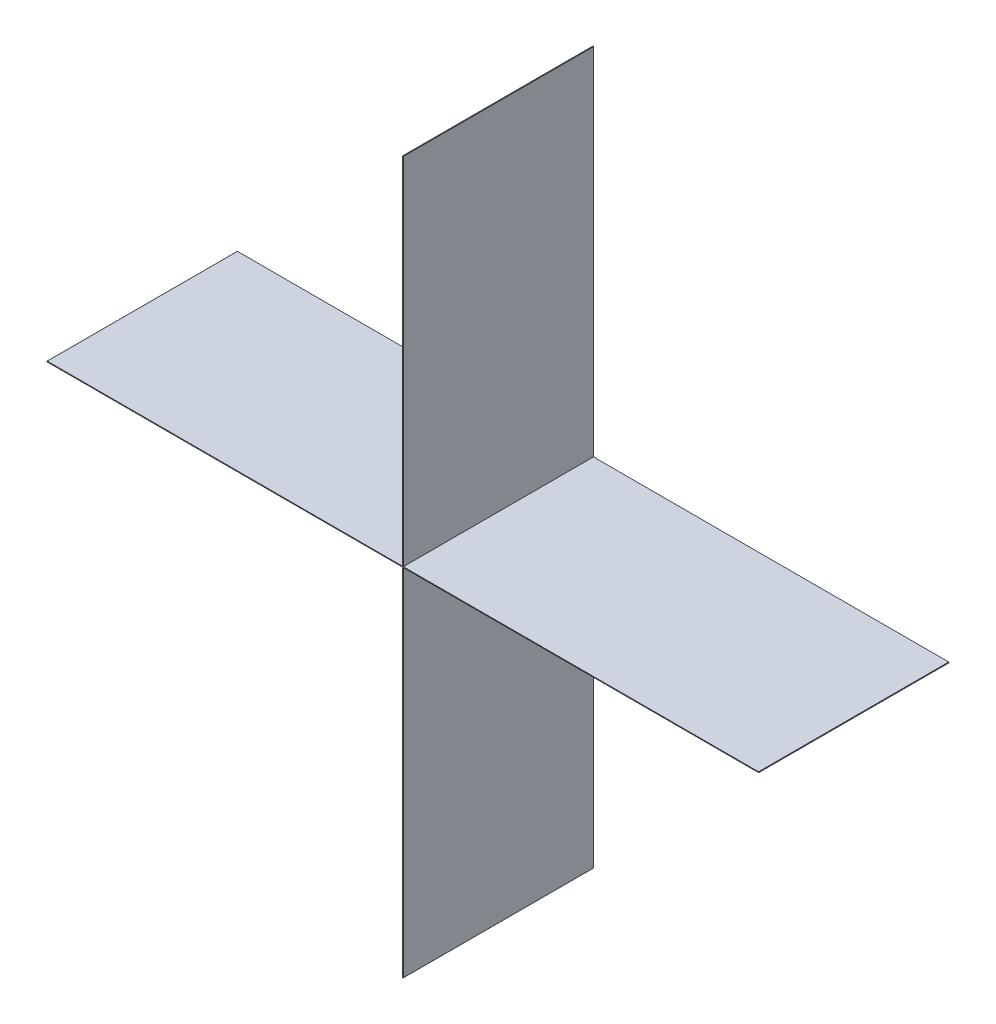
ISO-10303-21;
HEADER;
FILE_DESCRIPTION(('STEP AP214'),'2;1');
FILE_NAME('part.step','',(''),(''),'','','');
FILE_SCHEMA(('AUTOMOTIVE_DESIGN { 1 0 10303 214 1 1 1 1 }'));
ENDSEC;
DATA;
#1=APPLICATION_CONTEXT('core data for automotive mechanical design processes');
#2=APPLICATION_PROTOCOL_DEFINITION('international standard','automotive_design',2000,#1);
#3=PRODUCT_CONTEXT('',#1,'mechanical');
#4=PRODUCT('Part','Part','',(#3));
#5=PRODUCT_RELATED_PRODUCT_CATEGORY('part','',(#4));
#6=PRODUCT_DEFINITION_FORMATION('','',#4);
#7=PRODUCT_DEFINITION_CONTEXT('part definition',#1,'design');
#8=PRODUCT_DEFINITION('design','',#6,#7);
#9=PRODUCT_DEFINITION_SHAPE('','',#8);
#10=(LENGTH_UNIT() NAMED_UNIT(*) SI_UNIT(.MILLI.,.METRE.));
#11=(NAMED_UNIT(*) PLANE_ANGLE_UNIT() SI_UNIT($,.RADIAN.));
#12=(NAMED_UNIT(*) SI_UNIT($,.STERADIAN.) SOLID_ANGLE_UNIT());
#13=UNCERTAINTY_MEASURE_WITH_UNIT(LENGTH_MEASURE(1.E-05),#10,'distance_accuracy_value','');
#14=(GEOMETRIC_REPRESENTATION_CONTEXT(3) GLOBAL_UNCERTAINTY_ASSIGNED_CONTEXT((#13)) GLOBAL_UNIT_ASSIGNED_CONTEXT((#10,
#11,#12)) REPRESENTATION_CONTEXT('',''));
#15=CARTESIAN_POINT('',(0.,0.,0.));
#16=DIRECTION('',(0.,0.,1.));
#17=DIRECTION('',(1.,0.,0.));
#18=AXIS2_PLACEMENT_3D('',#15,#16,#17);
#19=CARTESIAN_POINT('',(-0.47499778,0.000508,0.));
#20=DIRECTION('',(0.,-1.,0.));
#21=DIRECTION('',(-1.,0.,0.));
#22=AXIS2_PLACEMENT_3D('',#19,#20,#21);
#23=PLANE('',#22);
#24=DIRECTION('',(-1.,0.,0.));
#25=VECTOR('',#24,1.);
#26=CARTESIAN_POINT('',(-0.47499778,0.000508,0.));
#27=LINE('',#26,#25);
#28=CARTESIAN_POINT('',(-0.47499778,0.000508,0.));
#29=VERTEX_POINT('',#28);
#30=CARTESIAN_POINT('',(-0.4752086,0.000508,0.));
#31=VERTEX_POINT('',#30);
#32=EDGE_CURVE('E11',#29,#31,#27,.T.);
#33=ORIENTED_EDGE('',*,*,#32,.T.);
#34=DIRECTION('',(0.,0.,1.));
#35=VECTOR('',#34,1.);
#36=CARTESIAN_POINT('',(-0.4752086,0.000508,0.));
#37=LINE('',#36,#35);
#38=CARTESIAN_POINT('',(-0.4752086,0.000508,0.254));
#39=VERTEX_POINT('',#38);
#40=EDGE_CURVE('E24',#31,#39,#37,.T.);
#41=ORIENTED_EDGE('',*,*,#40,.T.);
#42=DIRECTION('',(-1.,0.,0.));
#43=VECTOR('',#42,1.);
#44=CARTESIAN_POINT('',(-0.47499778,0.000508,0.254));
#45=LINE('',#44,#43);
#46=CARTESIAN_POINT('',(-0.47499778,0.000508,0.254));
#47=VERTEX_POINT('',#46);
#48=EDGE_CURVE('E494',#47,#39,#45,.T.);
#49=ORIENTED_EDGE('',*,*,#48,.F.);
#50=DIRECTION('',(0.,0.,1.));
#51=VECTOR('',#50,1.);
#52=CARTESIAN_POINT('',(-0.47499778,0.000508,0.));
#53=LINE('',#52,#51);
#54=EDGE_CURVE('E36',#29,#47,#53,.T.);
#55=ORIENTED_EDGE('',*,*,#54,.F.);
#56=EDGE_LOOP('',(#33,#41,#49,#55));
#57=FACE_BOUND('',#56,.T.);
#58=ADVANCED_FACE('F17',(#57),#23,.F.);
#59=CARTESIAN_POINT('',(-0.4752086,0.000508,0.));
#60=DIRECTION('',(0.71010931698383,-0.704091441456831,0.));
#61=DIRECTION('',(-0.704091441456831,-0.71010931698383,0.));
#62=AXIS2_PLACEMENT_3D('',#59,#60,#61);
#63=PLANE('',#62);
#64=DIRECTION('',(-0.704091441456831,-0.71010931698383,0.));
#65=VECTOR('',#64,1.);
#66=CARTESIAN_POINT('',(-0.4752086,0.000508,0.));
#67=LINE('',#66,#65);
#68=CARTESIAN_POINT('',(-0.47550578,0.000208279999999,0.));
#69=VERTEX_POINT('',#68);
#70=EDGE_CURVE('E491',#31,#69,#67,.T.);
#71=ORIENTED_EDGE('',*,*,#70,.T.);
#72=DIRECTION('',(0.,0.,1.));
#73=VECTOR('',#72,1.);
#74=CARTESIAN_POINT('',(-0.47550578,0.000208279999999,0.));
#75=LINE('',#74,#73);
#76=CARTESIAN_POINT('',(-0.47550578,0.000208279999999,0.254));
#77=VERTEX_POINT('',#76);
#78=EDGE_CURVE('E488',#69,#77,#75,.T.);
#79=ORIENTED_EDGE('',*,*,#78,.T.);
#80=DIRECTION('',(-0.704091441456831,-0.71010931698383,0.));
#81=VECTOR('',#80,1.);
#82=CARTESIAN_POINT('',(-0.4752086,0.000508,0.254));
#83=LINE('',#82,#81);
#84=EDGE_CURVE('E486',#39,#77,#83,.T.);
#85=ORIENTED_EDGE('',*,*,#84,.F.);
#86=ORIENTED_EDGE('',*,*,#40,.F.);
#87=EDGE_LOOP('',(#71,#79,#85,#86));
#88=FACE_BOUND('',#87,.T.);
#89=ADVANCED_FACE('F496',(#88),#63,.F.);
#90=CARTESIAN_POINT('',(-0.47550578,0.000208279999999,0.));
#91=DIRECTION('',(1.,0.,0.));
#92=DIRECTION('',(0.,-1.,0.));
#93=AXIS2_PLACEMENT_3D('',#90,#91,#92);
#94=PLANE('',#93);
#95=DIRECTION('',(0.,-1.,0.));
#96=VECTOR('',#95,1.);
#97=CARTESIAN_POINT('',(-0.47550578,0.000208279999999,0.));
#98=LINE('',#97,#96);
#99=CARTESIAN_POINT('',(-0.47550578,-0.0002108199999995,0.));
#100=VERTEX_POINT('',#99);
#101=EDGE_CURVE('E483',#69,#100,#98,.T.);
#102=ORIENTED_EDGE('',*,*,#101,.T.);
#103=DIRECTION('',(0.,0.,1.));
#104=VECTOR('',#103,1.);
#105=CARTESIAN_POINT('',(-0.47550578,-0.0002108199999995,0.));
#106=LINE('',#105,#104);
#107=CARTESIAN_POINT('',(-0.47550578,-0.0002108199999995,0.254));
#108=VERTEX_POINT('',#107);
#109=EDGE_CURVE('E480',#100,#108,#106,.T.);
#110=ORIENTED_EDGE('',*,*,#109,.T.);
#111=DIRECTION('',(0.,-1.,0.));
#112=VECTOR('',#111,1.);
#113=CARTESIAN_POINT('',(-0.47550578,0.000208279999999,0.254));
#114=LINE('',#113,#112);
#115=EDGE_CURVE('E478',#77,#108,#114,.T.);
#116=ORIENTED_EDGE('',*,*,#115,.F.);
#117=ORIENTED_EDGE('',*,*,#78,.F.);
#118=EDGE_LOOP('',(#102,#110,#116,#117));
#119=FACE_BOUND('',#118,.T.);
#120=ADVANCED_FACE('F500',(#119),#94,.F.);
#121=CARTESIAN_POINT('',(-0.47550578,-0.0002108199999995,0.));
#122=DIRECTION('',(0.707106781165048,0.707106781208048,0.));
#123=DIRECTION('',(0.707106781208048,-0.707106781165048,0.));
#124=AXIS2_PLACEMENT_3D('',#121,#122,#123);
#125=PLANE('',#124);
#126=DIRECTION('',(0.707106781208048,-0.707106781165048,0.));
#127=VECTOR('',#126,1.);
#128=CARTESIAN_POINT('',(-0.47550578,-0.0002108199999995,0.));
#129=LINE('',#128,#127);
#130=CARTESIAN_POINT('',(-0.4752086,-0.000508,0.));
#131=VERTEX_POINT('',#130);
#132=EDGE_CURVE('E475',#100,#131,#129,.T.);
#133=ORIENTED_EDGE('',*,*,#132,.T.);
#134=DIRECTION('',(0.,0.,1.));
#135=VECTOR('',#134,1.);
#136=CARTESIAN_POINT('',(-0.4752086,-0.000508,0.));
#137=LINE('',#136,#135);
#138=CARTESIAN_POINT('',(-0.4752086,-0.000508,0.254));
#139=VERTEX_POINT('',#138);
#140=EDGE_CURVE('E472',#131,#139,#137,.T.);
#141=ORIENTED_EDGE('',*,*,#140,.T.);
#142=DIRECTION('',(0.707106781208048,-0.707106781165048,0.));
#143=VECTOR('',#142,1.);
#144=CARTESIAN_POINT('',(-0.47550578,-0.0002108199999995,0.254));
#145=LINE('',#144,#143);
#146=EDGE_CURVE('E470',#108,#139,#145,.T.);
#147=ORIENTED_EDGE('',*,*,#146,.F.);
#148=ORIENTED_EDGE('',*,*,#109,.F.);
#149=EDGE_LOOP('',(#133,#141,#147,#148));
#150=FACE_BOUND('',#149,.T.);
#151=ADVANCED_FACE('F504',(#150),#125,.F.);
#152=CARTESIAN_POINT('',(-0.4752086,-0.000508,0.));
#153=DIRECTION('',(0.,1.,0.));
#154=DIRECTION('',(1.,0.,0.));
#155=AXIS2_PLACEMENT_3D('',#152,#153,#154);
#156=PLANE('',#155);
#157=DIRECTION('',(1.,0.,0.));
#158=VECTOR('',#157,1.);
#159=CARTESIAN_POINT('',(-0.4752086,-0.000508,0.));
#160=LINE('',#159,#158);
#161=CARTESIAN_POINT('',(-0.47499778,-0.000508,0.));
#162=VERTEX_POINT('',#161);
#163=EDGE_CURVE('E467',#131,#162,#160,.T.);
#164=ORIENTED_EDGE('',*,*,#163,.T.);
#165=DIRECTION('',(0.,0.,1.));
#166=VECTOR('',#165,1.);
#167=CARTESIAN_POINT('',(-0.47499778,-0.000508,0.));
#168=LINE('',#167,#166);
#169=CARTESIAN_POINT('',(-0.47499778,-0.000508,0.254));
#170=VERTEX_POINT('',#169);
#171=EDGE_CURVE('E464',#162,#170,#168,.T.);
#172=ORIENTED_EDGE('',*,*,#171,.T.);
#173=DIRECTION('',(1.,0.,0.));
#174=VECTOR('',#173,1.);
#175=CARTESIAN_POINT('',(-0.4752086,-0.000508,0.254));
#176=LINE('',#175,#174);
#177=EDGE_CURVE('E462',#139,#170,#176,.T.);
#178=ORIENTED_EDGE('',*,*,#177,.F.);
#179=ORIENTED_EDGE('',*,*,#140,.F.);
#180=EDGE_LOOP('',(#164,#172,#178,#179));
#181=FACE_BOUND('',#180,.T.);
#182=ADVANCED_FACE('F508',(#181),#156,.F.);
#183=CARTESIAN_POINT('',(-0.47499778,-0.000508,0.));
#184=DIRECTION('',(0.,1.,0.));
#185=DIRECTION('',(1.,0.,0.));
#186=AXIS2_PLACEMENT_3D('',#183,#184,#185);
#187=PLANE('',#186);
#188=DIRECTION('',(1.,0.,0.));
#189=VECTOR('',#188,1.);
#190=CARTESIAN_POINT('',(-0.47499778,-0.000508,0.));
#191=LINE('',#190,#189);
#192=CARTESIAN_POINT('',(-0.0005054599999852,-0.000508,0.));
#193=VERTEX_POINT('',#192);
#194=EDGE_CURVE('E459',#162,#193,#191,.T.);
#195=ORIENTED_EDGE('',*,*,#194,.T.);
#196=DIRECTION('',(0.,0.,1.));
#197=VECTOR('',#196,1.);
#198=CARTESIAN_POINT('',(-0.0005054599999852,-0.000508,0.));
#199=LINE('',#198,#197);
#200=CARTESIAN_POINT('',(-0.0005054599999852,-0.000508,0.254));
#201=VERTEX_POINT('',#200);
#202=EDGE_CURVE('E456',#193,#201,#199,.T.);
#203=ORIENTED_EDGE('',*,*,#202,.T.);
#204=DIRECTION('',(1.,0.,0.));
#205=VECTOR('',#204,1.);
#206=CARTESIAN_POINT('',(-0.47499778,-0.000508,0.254));
#207=LINE('',#206,#205);
#208=EDGE_CURVE('E454',#170,#201,#207,.T.);
#209=ORIENTED_EDGE('',*,*,#208,.F.);
#210=ORIENTED_EDGE('',*,*,#171,.F.);
#211=EDGE_LOOP('',(#195,#203,#209,#210));
#212=FACE_BOUND('',#211,.T.);
#213=ADVANCED_FACE('F512',(#212),#187,.F.);
#214=CARTESIAN_POINT('',(-0.0005054599999852,-0.000508,0.));
#215=DIRECTION('',(1.,0.,0.));
#216=DIRECTION('',(0.,-1.,0.));
#217=AXIS2_PLACEMENT_3D('',#214,#215,#216);
#218=PLANE('',#217);
#219=DIRECTION('',(0.,-1.,0.));
#220=VECTOR('',#219,1.);
#221=CARTESIAN_POINT('',(-0.0005054599999852,-0.000508,0.));
#222=LINE('',#221,#220);
#223=CARTESIAN_POINT('',(-0.0005054599999852,-0.47500032,0.));
#224=VERTEX_POINT('',#223);
#225=EDGE_CURVE('E451',#193,#224,#222,.T.);
#226=ORIENTED_EDGE('',*,*,#225,.T.);
#227=DIRECTION('',(0.,0.,1.));
#228=VECTOR('',#227,1.);
#229=CARTESIAN_POINT('',(-0.0005054599999852,-0.47500032,0.));
#230=LINE('',#229,#228);
#231=CARTESIAN_POINT('',(-0.0005054599999852,-0.47500032,0.254));
#232=VERTEX_POINT('',#231);
#233=EDGE_CURVE('E448',#224,#232,#230,.T.);
#234=ORIENTED_EDGE('',*,*,#233,.T.);
#235=DIRECTION('',(0.,-1.,0.));
#236=VECTOR('',#235,1.);
#237=CARTESIAN_POINT('',(-0.0005054599999852,-0.000508,0.254));
#238=LINE('',#237,#236);
#239=EDGE_CURVE('E446',#201,#232,#238,.T.);
#240=ORIENTED_EDGE('',*,*,#239,.F.);
#241=ORIENTED_EDGE('',*,*,#202,.F.);
#242=EDGE_LOOP('',(#226,#234,#240,#241));
#243=FACE_BOUND('',#242,.T.);
#244=ADVANCED_FACE('F516',(#243),#218,.F.);
#245=CARTESIAN_POINT('',(-0.0005054599999852,-0.47500032,0.));
#246=DIRECTION('',(1.,0.,0.));
#247=DIRECTION('',(0.,-1.,0.));
#248=AXIS2_PLACEMENT_3D('',#245,#246,#247);
#249=PLANE('',#248);
#250=DIRECTION('',(0.,-1.,0.));
#251=VECTOR('',#250,1.);
#252=CARTESIAN_POINT('',(-0.0005054599999852,-0.47500032,0.));
#253=LINE('',#252,#251);
#254=CARTESIAN_POINT('',(-0.0005054599999852,-0.47521114,0.));
#255=VERTEX_POINT('',#254);
#256=EDGE_CURVE('E443',#224,#255,#253,.T.);
#257=ORIENTED_EDGE('',*,*,#256,.T.);
#258=DIRECTION('',(0.,0.,1.));
#259=VECTOR('',#258,1.);
#260=CARTESIAN_POINT('',(-0.0005054599999852,-0.47521114,0.));
#261=LINE('',#260,#259);
#262=CARTESIAN_POINT('',(-0.0005054599999852,-0.47521114,0.254));
#263=VERTEX_POINT('',#262);
#264=EDGE_CURVE('E440',#255,#263,#261,.T.);
#265=ORIENTED_EDGE('',*,*,#264,.T.);
#266=DIRECTION('',(0.,-1.,0.));
#267=VECTOR('',#266,1.);
#268=CARTESIAN_POINT('',(-0.0005054599999852,-0.47500032,0.254));
#269=LINE('',#268,#267);
#270=EDGE_CURVE('E438',#232,#263,#269,.T.);
#271=ORIENTED_EDGE('',*,*,#270,.F.);
#272=ORIENTED_EDGE('',*,*,#233,.F.);
#273=EDGE_LOOP('',(#257,#265,#271,#272));
#274=FACE_BOUND('',#273,.T.);
#275=ADVANCED_FACE('F520',(#274),#249,.F.);
#276=CARTESIAN_POINT('',(-0.0005054599999852,-0.47521114,0.));
#277=DIRECTION('',(0.707106781199048,0.707106781174048,0.));
#278=DIRECTION('',(0.707106781174048,-0.707106781199048,0.));
#279=AXIS2_PLACEMENT_3D('',#276,#277,#278);
#280=PLANE('',#279);
#281=DIRECTION('',(0.707106781174048,-0.707106781199048,0.));
#282=VECTOR('',#281,1.);
#283=CARTESIAN_POINT('',(-0.0005054599999852,-0.47521114,0.));
#284=LINE('',#283,#282);
#285=CARTESIAN_POINT('',(-0.0002082799999954,-0.47550832,0.));
#286=VERTEX_POINT('',#285);
#287=EDGE_CURVE('E435',#255,#286,#284,.T.);
#288=ORIENTED_EDGE('',*,*,#287,.T.);
#289=DIRECTION('',(0.,0.,1.));
#290=VECTOR('',#289,1.);
#291=CARTESIAN_POINT('',(-0.0002082799999954,-0.47550832,0.));
#292=LINE('',#291,#290);
#293=CARTESIAN_POINT('',(-0.0002082799999954,-0.47550832,0.254));
#294=VERTEX_POINT('',#293);
#295=EDGE_CURVE('E432',#286,#294,#292,.T.);
#296=ORIENTED_EDGE('',*,*,#295,.T.);
#297=DIRECTION('',(0.707106781174048,-0.707106781199048,0.));
#298=VECTOR('',#297,1.);
#299=CARTESIAN_POINT('',(-0.0005054599999852,-0.47521114,0.254));
#300=LINE('',#299,#298);
#301=EDGE_CURVE('E430',#263,#294,#300,.T.);
#302=ORIENTED_EDGE('',*,*,#301,.F.);
#303=ORIENTED_EDGE('',*,*,#264,.F.);
#304=EDGE_LOOP('',(#288,#296,#302,#303));
#305=FACE_BOUND('',#304,.T.);
#306=ADVANCED_FACE('F524',(#305),#280,.F.);
#307=CARTESIAN_POINT('',(-0.0002082799999954,-0.47550832,0.));
#308=DIRECTION('',(0.,1.,0.));
#309=DIRECTION('',(1.,0.,0.));
#310=AXIS2_PLACEMENT_3D('',#307,#308,#309);
#311=PLANE('',#310);
#312=DIRECTION('',(1.,0.,0.));
#313=VECTOR('',#312,1.);
#314=CARTESIAN_POINT('',(-0.0002082799999954,-0.47550832,0.));
#315=LINE('',#314,#313);
#316=CARTESIAN_POINT('',(0.0002108199999924,-0.47550832,0.));
#317=VERTEX_POINT('',#316);
#318=EDGE_CURVE('E427',#286,#317,#315,.T.);
#319=ORIENTED_EDGE('',*,*,#318,.T.);
#320=DIRECTION('',(0.,0.,1.));
#321=VECTOR('',#320,1.);
#322=CARTESIAN_POINT('',(0.0002108199999924,-0.47550832,0.));
#323=LINE('',#322,#321);
#324=CARTESIAN_POINT('',(0.0002108199999924,-0.47550832,0.254));
#325=VERTEX_POINT('',#324);
#326=EDGE_CURVE('E424',#317,#325,#323,.T.);
#327=ORIENTED_EDGE('',*,*,#326,.T.);
#328=DIRECTION('',(1.,0.,0.));
#329=VECTOR('',#328,1.);
#330=CARTESIAN_POINT('',(-0.0002082799999954,-0.47550832,0.254));
#331=LINE('',#330,#329);
#332=EDGE_CURVE('E422',#294,#325,#331,.T.);
#333=ORIENTED_EDGE('',*,*,#332,.F.);
#334=ORIENTED_EDGE('',*,*,#295,.F.);
#335=EDGE_LOOP('',(#319,#327,#333,#334));
#336=FACE_BOUND('',#335,.T.);
#337=ADVANCED_FACE('F528',(#336),#311,.F.);
#338=CARTESIAN_POINT('',(0.0002108199999924,-0.47550832,0.));
#339=DIRECTION('',(-0.70409144141917,0.710109317021172,0.));
#340=DIRECTION('',(0.710109317021172,0.70409144141917,0.));
#341=AXIS2_PLACEMENT_3D('',#338,#339,#340);
#342=PLANE('',#341);
#343=DIRECTION('',(0.710109317021172,0.70409144141917,0.));
#344=VECTOR('',#343,1.);
#345=CARTESIAN_POINT('',(0.0002108199999924,-0.47550832,0.));
#346=LINE('',#345,#344);
#347=CARTESIAN_POINT('',(0.0005105400000076,-0.47521114,0.));
#348=VERTEX_POINT('',#347);
#349=EDGE_CURVE('E419',#317,#348,#346,.T.);
#350=ORIENTED_EDGE('',*,*,#349,.T.);
#351=DIRECTION('',(0.,0.,1.));
#352=VECTOR('',#351,1.);
#353=CARTESIAN_POINT('',(0.0005105400000076,-0.47521114,0.));
#354=LINE('',#353,#352);
#355=CARTESIAN_POINT('',(0.0005105400000076,-0.47521114,0.254));
#356=VERTEX_POINT('',#355);
#357=EDGE_CURVE('E416',#348,#356,#354,.T.);
#358=ORIENTED_EDGE('',*,*,#357,.T.);
#359=DIRECTION('',(0.710109317021172,0.70409144141917,0.));
#360=VECTOR('',#359,1.);
#361=CARTESIAN_POINT('',(0.0002108199999924,-0.47550832,0.254));
#362=LINE('',#361,#360);
#363=EDGE_CURVE('E414',#325,#356,#362,.T.);
#364=ORIENTED_EDGE('',*,*,#363,.F.);
#365=ORIENTED_EDGE('',*,*,#326,.F.);
#366=EDGE_LOOP('',(#350,#358,#364,#365));
#367=FACE_BOUND('',#366,.T.);
#368=ADVANCED_FACE('F532',(#367),#342,.F.);
#369=CARTESIAN_POINT('',(0.0005105400000076,-0.47521114,0.));
#370=DIRECTION('',(-1.,0.,0.));
#371=DIRECTION('',(0.,1.,0.));
#372=AXIS2_PLACEMENT_3D('',#369,#370,#371);
#373=PLANE('',#372);
#374=DIRECTION('',(0.,1.,0.));
#375=VECTOR('',#374,1.);
#376=CARTESIAN_POINT('',(0.0005105400000076,-0.47521114,0.));
#377=LINE('',#376,#375);
#378=CARTESIAN_POINT('',(0.0005105400000076,-0.47500032,0.));
#379=VERTEX_POINT('',#378);
#380=EDGE_CURVE('E411',#348,#379,#377,.T.);
#381=ORIENTED_EDGE('',*,*,#380,.T.);
#382=DIRECTION('',(0.,0.,1.));
#383=VECTOR('',#382,1.);
#384=CARTESIAN_POINT('',(0.0005105400000076,-0.47500032,0.));
#385=LINE('',#384,#383);
#386=CARTESIAN_POINT('',(0.0005105400000076,-0.47500032,0.254));
#387=VERTEX_POINT('',#386);
#388=EDGE_CURVE('E408',#379,#387,#385,.T.);
#389=ORIENTED_EDGE('',*,*,#388,.T.);
#390=DIRECTION('',(0.,1.,0.));
#391=VECTOR('',#390,1.);
#392=CARTESIAN_POINT('',(0.0005105400000076,-0.47521114,0.254));
#393=LINE('',#392,#391);
#394=EDGE_CURVE('E406',#356,#387,#393,.T.);
#395=ORIENTED_EDGE('',*,*,#394,.F.);
#396=ORIENTED_EDGE('',*,*,#357,.F.);
#397=EDGE_LOOP('',(#381,#389,#395,#396));
#398=FACE_BOUND('',#397,.T.);
#399=ADVANCED_FACE('F536',(#398),#373,.F.);
#400=CARTESIAN_POINT('',(0.0005105400000076,-0.47500032,0.));
#401=DIRECTION('',(-1.,0.,0.));
#402=DIRECTION('',(0.,1.,0.));
#403=AXIS2_PLACEMENT_3D('',#400,#401,#402);
#404=PLANE('',#403);
#405=DIRECTION('',(0.,1.,0.));
#406=VECTOR('',#405,1.);
#407=CARTESIAN_POINT('',(0.0005105400000076,-0.47500032,0.));
#408=LINE('',#407,#406);
#409=CARTESIAN_POINT('',(0.0005105400000076,-0.000508,0.));
#410=VERTEX_POINT('',#409);
#411=EDGE_CURVE('E403',#379,#410,#408,.T.);
#412=ORIENTED_EDGE('',*,*,#411,.T.);
#413=DIRECTION('',(0.,0.,1.));
#414=VECTOR('',#413,1.);
#415=CARTESIAN_POINT('',(0.0005105400000076,-0.000508,0.));
#416=LINE('',#415,#414);
#417=CARTESIAN_POINT('',(0.0005105400000076,-0.000508,0.254));
#418=VERTEX_POINT('',#417);
#419=EDGE_CURVE('E400',#410,#418,#416,.T.);
#420=ORIENTED_EDGE('',*,*,#419,.T.);
#421=DIRECTION('',(0.,1.,0.));
#422=VECTOR('',#421,1.);
#423=CARTESIAN_POINT('',(0.0005105400000076,-0.47500032,0.254));
#424=LINE('',#423,#422);
#425=EDGE_CURVE('E398',#387,#418,#424,.T.);
#426=ORIENTED_EDGE('',*,*,#425,.F.);
#427=ORIENTED_EDGE('',*,*,#388,.F.);
#428=EDGE_LOOP('',(#412,#420,#426,#427));
#429=FACE_BOUND('',#428,.T.);
#430=ADVANCED_FACE('F540',(#429),#404,.F.);
#431=CARTESIAN_POINT('',(0.0005105400000076,-0.000508,0.));
#432=DIRECTION('',(0.,1.,0.));
#433=DIRECTION('',(1.,0.,0.));
#434=AXIS2_PLACEMENT_3D('',#431,#432,#433);
#435=PLANE('',#434);
#436=DIRECTION('',(1.,0.,0.));
#437=VECTOR('',#436,1.);
#438=CARTESIAN_POINT('',(0.0005105400000076,-0.000508,0.));
#439=LINE('',#438,#437);
#440=CARTESIAN_POINT('',(0.47500032,-0.000508,0.));
#441=VERTEX_POINT('',#440);
#442=EDGE_CURVE('E395',#410,#441,#439,.T.);
#443=ORIENTED_EDGE('',*,*,#442,.T.);
#444=DIRECTION('',(0.,0.,1.));
#445=VECTOR('',#444,1.);
#446=CARTESIAN_POINT('',(0.47500032,-0.000508,0.));
#447=LINE('',#446,#445);
#448=CARTESIAN_POINT('',(0.47500032,-0.000508,0.254));
#449=VERTEX_POINT('',#448);
#450=EDGE_CURVE('E392',#441,#449,#447,.T.);
#451=ORIENTED_EDGE('',*,*,#450,.T.);
#452=DIRECTION('',(1.,0.,0.));
#453=VECTOR('',#452,1.);
#454=CARTESIAN_POINT('',(0.0005105400000076,-0.000508,0.254));
#455=LINE('',#454,#453);
#456=EDGE_CURVE('E390',#418,#449,#455,.T.);
#457=ORIENTED_EDGE('',*,*,#456,.F.);
#458=ORIENTED_EDGE('',*,*,#419,.F.);
#459=EDGE_LOOP('',(#443,#451,#457,#458));
#460=FACE_BOUND('',#459,.T.);
#461=ADVANCED_FACE('F544',(#460),#435,.F.);
#462=CARTESIAN_POINT('',(0.47500032,-0.000508,0.));
#463=DIRECTION('',(0.,1.,0.));
#464=DIRECTION('',(1.,0.,0.));
#465=AXIS2_PLACEMENT_3D('',#462,#463,#464);
#466=PLANE('',#465);
#467=DIRECTION('',(1.,0.,0.));
#468=VECTOR('',#467,1.);
#469=CARTESIAN_POINT('',(0.47500032,-0.000508,0.));
#470=LINE('',#469,#468);
#471=CARTESIAN_POINT('',(0.47509938,-0.000508,0.));
#472=VERTEX_POINT('',#471);
#473=EDGE_CURVE('E387',#441,#472,#470,.T.);
#474=ORIENTED_EDGE('',*,*,#473,.T.);
#475=DIRECTION('',(0.,0.,1.));
#476=VECTOR('',#475,1.);
#477=CARTESIAN_POINT('',(0.47509938,-0.000508,0.));
#478=LINE('',#477,#476);
#479=CARTESIAN_POINT('',(0.47509938,-0.000508,0.254));
#480=VERTEX_POINT('',#479);
#481=EDGE_CURVE('E384',#472,#480,#478,.T.);
#482=ORIENTED_EDGE('',*,*,#481,.T.);
#483=DIRECTION('',(1.,0.,0.));
#484=VECTOR('',#483,1.);
#485=CARTESIAN_POINT('',(0.47500032,-0.000508,0.254));
#486=LINE('',#485,#484);
#487=EDGE_CURVE('E382',#449,#480,#486,.T.);
#488=ORIENTED_EDGE('',*,*,#487,.F.);
#489=ORIENTED_EDGE('',*,*,#450,.F.);
#490=EDGE_LOOP('',(#474,#482,#488,#489));
#491=FACE_BOUND('',#490,.T.);
#492=ADVANCED_FACE('F548',(#491),#466,.F.);
#493=CARTESIAN_POINT('',(0.47509938,-0.000508,0.));
#494=DIRECTION('',(-0.375705108749153,0.926739268219377,0.));
#495=DIRECTION('',(0.926739268219377,0.375705108749153,0.));
#496=AXIS2_PLACEMENT_3D('',#493,#494,#495);
#497=PLANE('',#496);
#498=DIRECTION('',(0.926739268219377,0.375705108749153,0.));
#499=VECTOR('',#498,1.);
#500=CARTESIAN_POINT('',(0.47509938,-0.000508,0.));
#501=LINE('',#500,#499);
#502=CARTESIAN_POINT('',(0.47528734,-0.0004318000000012,0.));
#503=VERTEX_POINT('',#502);
#504=EDGE_CURVE('E379',#472,#503,#501,.T.);
#505=ORIENTED_EDGE('',*,*,#504,.T.);
#506=DIRECTION('',(0.,0.,1.));
#507=VECTOR('',#506,1.);
#508=CARTESIAN_POINT('',(0.47528734,-0.0004318000000012,0.));
#509=LINE('',#508,#507);
#510=CARTESIAN_POINT('',(0.47528734,-0.0004318000000012,0.254));
#511=VERTEX_POINT('',#510);
#512=EDGE_CURVE('E376',#503,#511,#509,.T.);
#513=ORIENTED_EDGE('',*,*,#512,.T.);
#514=DIRECTION('',(0.926739268219377,0.375705108749153,0.));
#515=VECTOR('',#514,1.);
#516=CARTESIAN_POINT('',(0.47509938,-0.000508,0.254));
#517=LINE('',#516,#515);
#518=EDGE_CURVE('E374',#480,#511,#517,.T.);
#519=ORIENTED_EDGE('',*,*,#518,.F.);
#520=ORIENTED_EDGE('',*,*,#481,.F.);
#521=EDGE_LOOP('',(#505,#513,#519,#520));
#522=FACE_BOUND('',#521,.T.);
#523=ADVANCED_FACE('F552',(#522),#497,.F.);
#524=CARTESIAN_POINT('',(0.47528734,-0.0004318000000012,0.));
#525=DIRECTION('',(-0.707106781186548,0.707106781186548,0.));
#526=DIRECTION('',(0.707106781186548,0.707106781186548,0.));
#527=AXIS2_PLACEMENT_3D('',#524,#525,#526);
#528=PLANE('',#527);
#529=DIRECTION('',(0.707106781186548,0.707106781186548,0.));
#530=VECTOR('',#529,1.);
#531=CARTESIAN_POINT('',(0.47528734,-0.0004318000000012,0.));
#532=LINE('',#531,#530);
#533=CARTESIAN_POINT('',(0.47542958,-0.0002895599999988,0.));
#534=VERTEX_POINT('',#533);
#535=EDGE_CURVE('E371',#503,#534,#532,.T.);
#536=ORIENTED_EDGE('',*,*,#535,.T.);
#537=DIRECTION('',(0.,0.,1.));
#538=VECTOR('',#537,1.);
#539=CARTESIAN_POINT('',(0.47542958,-0.0002895599999988,0.));
#540=LINE('',#539,#538);
#541=CARTESIAN_POINT('',(0.47542958,-0.0002895599999988,0.254));
#542=VERTEX_POINT('',#541);
#543=EDGE_CURVE('E368',#534,#542,#540,.T.);
#544=ORIENTED_EDGE('',*,*,#543,.T.);
#545=DIRECTION('',(0.707106781186548,0.707106781186548,0.));
#546=VECTOR('',#545,1.);
#547=CARTESIAN_POINT('',(0.47528734,-0.0004318000000012,0.254));
#548=LINE('',#547,#546);
#549=EDGE_CURVE('E366',#511,#542,#548,.T.);
#550=ORIENTED_EDGE('',*,*,#549,.F.);
#551=ORIENTED_EDGE('',*,*,#512,.F.);
#552=EDGE_LOOP('',(#536,#544,#550,#551));
#553=FACE_BOUND('',#552,.T.);
#554=ADVANCED_FACE('F556',(#553),#528,.F.);
#555=CARTESIAN_POINT('',(0.47542958,-0.0002895599999988,0.));
#556=DIRECTION('',(-0.922337709840803,0.386384716319917,0.));
#557=DIRECTION('',(0.386384716319917,0.922337709840803,0.));
#558=AXIS2_PLACEMENT_3D('',#555,#556,#557);
#559=PLANE('',#558);
#560=DIRECTION('',(0.386384716319917,0.922337709840803,0.));
#561=VECTOR('',#560,1.);
#562=CARTESIAN_POINT('',(0.47542958,-0.0002895599999988,0.));
#563=LINE('',#562,#561);
#564=CARTESIAN_POINT('',(0.47550832,-0.0001016000000007,0.));
#565=VERTEX_POINT('',#564);
#566=EDGE_CURVE('E363',#534,#565,#563,.T.);
#567=ORIENTED_EDGE('',*,*,#566,.T.);
#568=DIRECTION('',(0.,0.,1.));
#569=VECTOR('',#568,1.);
#570=CARTESIAN_POINT('',(0.47550832,-0.0001016000000007,0.));
#571=LINE('',#570,#569);
#572=CARTESIAN_POINT('',(0.47550832,-0.0001016000000007,0.254));
#573=VERTEX_POINT('',#572);
#574=EDGE_CURVE('E360',#565,#573,#571,.T.);
#575=ORIENTED_EDGE('',*,*,#574,.T.);
#576=DIRECTION('',(0.386384716319917,0.922337709840803,0.));
#577=VECTOR('',#576,1.);
#578=CARTESIAN_POINT('',(0.47542958,-0.0002895599999988,0.254));
#579=LINE('',#578,#577);
#580=EDGE_CURVE('E358',#542,#573,#579,.T.);
#581=ORIENTED_EDGE('',*,*,#580,.F.);
#582=ORIENTED_EDGE('',*,*,#543,.F.);
#583=EDGE_LOOP('',(#567,#575,#581,#582));
#584=FACE_BOUND('',#583,.T.);
#585=ADVANCED_FACE('F560',(#584),#559,.F.);
#586=CARTESIAN_POINT('',(0.47550832,-0.0001016000000007,0.));
#587=DIRECTION('',(-1.,0.,0.));
#588=DIRECTION('',(0.,1.,0.));
#589=AXIS2_PLACEMENT_3D('',#586,#587,#588);
#590=PLANE('',#589);
#591=DIRECTION('',(0.,1.,0.));
#592=VECTOR('',#591,1.);
#593=CARTESIAN_POINT('',(0.47550832,-0.0001016000000007,0.));
#594=LINE('',#593,#592);
#595=CARTESIAN_POINT('',(0.47550832,0.,0.));
#596=VERTEX_POINT('',#595);
#597=EDGE_CURVE('E355',#565,#596,#594,.T.);
#598=ORIENTED_EDGE('',*,*,#597,.T.);
#599=DIRECTION('',(0.,0.,1.));
#600=VECTOR('',#599,1.);
#601=CARTESIAN_POINT('',(0.47550832,0.,0.));
#602=LINE('',#601,#600);
#603=CARTESIAN_POINT('',(0.47550832,0.,0.254));
#604=VERTEX_POINT('',#603);
#605=EDGE_CURVE('E352',#596,#604,#602,.T.);
#606=ORIENTED_EDGE('',*,*,#605,.T.);
#607=DIRECTION('',(0.,1.,0.));
#608=VECTOR('',#607,1.);
#609=CARTESIAN_POINT('',(0.47550832,-0.0001016000000007,0.254));
#610=LINE('',#609,#608);
#611=EDGE_CURVE('E350',#573,#604,#610,.T.);
#612=ORIENTED_EDGE('',*,*,#611,.F.);
#613=ORIENTED_EDGE('',*,*,#574,.F.);
#614=EDGE_LOOP('',(#598,#606,#612,#613));
#615=FACE_BOUND('',#614,.T.);
#616=ADVANCED_FACE('F564',(#615),#590,.F.);
#617=CARTESIAN_POINT('',(0.47550832,0.,0.));
#618=DIRECTION('',(-1.,0.,0.));
#619=DIRECTION('',(0.,1.,0.));
#620=AXIS2_PLACEMENT_3D('',#617,#618,#619);
#621=PLANE('',#620);
#622=DIRECTION('',(0.,1.,0.));
#623=VECTOR('',#622,1.);
#624=CARTESIAN_POINT('',(0.47550832,0.,0.));
#625=LINE('',#624,#623);
#626=CARTESIAN_POINT('',(0.47550832,9.906000000015E-05,0.));
#627=VERTEX_POINT('',#626);
#628=EDGE_CURVE('E347',#596,#627,#625,.T.);
#629=ORIENTED_EDGE('',*,*,#628,.T.);
#630=DIRECTION('',(0.,0.,1.));
#631=VECTOR('',#630,1.);
#632=CARTESIAN_POINT('',(0.47550832,9.906000000015E-05,0.));
#633=LINE('',#632,#631);
#634=CARTESIAN_POINT('',(0.47550832,9.906000000015E-05,0.254));
#635=VERTEX_POINT('',#634);
#636=EDGE_CURVE('E344',#627,#635,#633,.T.);
#637=ORIENTED_EDGE('',*,*,#636,.T.);
#638=DIRECTION('',(0.,1.,0.));
#639=VECTOR('',#638,1.);
#640=CARTESIAN_POINT('',(0.47550832,0.,0.254));
#641=LINE('',#640,#639);
#642=EDGE_CURVE('E342',#604,#635,#641,.T.);
#643=ORIENTED_EDGE('',*,*,#642,.F.);
#644=ORIENTED_EDGE('',*,*,#605,.F.);
#645=EDGE_LOOP('',(#629,#637,#643,#644));
#646=FACE_BOUND('',#645,.T.);
#647=ADVANCED_FACE('F568',(#646),#621,.F.);
#648=CARTESIAN_POINT('',(0.47550832,9.906000000015E-05,0.));
#649=DIRECTION('',(-0.922337709840803,-0.386384716319917,0.));
#650=DIRECTION('',(-0.386384716319917,0.922337709840803,0.));
#651=AXIS2_PLACEMENT_3D('',#648,#649,#650);
#652=PLANE('',#651);
#653=DIRECTION('',(-0.386384716319917,0.922337709840803,0.));
#654=VECTOR('',#653,1.);
#655=CARTESIAN_POINT('',(0.47550832,9.906000000015E-05,0.));
#656=LINE('',#655,#654);
#657=CARTESIAN_POINT('',(0.47542958,0.0002870199999983,0.));
#658=VERTEX_POINT('',#657);
#659=EDGE_CURVE('E339',#627,#658,#656,.T.);
#660=ORIENTED_EDGE('',*,*,#659,.T.);
#661=DIRECTION('',(0.,0.,1.));
#662=VECTOR('',#661,1.);
#663=CARTESIAN_POINT('',(0.47542958,0.0002870199999983,0.));
#664=LINE('',#663,#662);
#665=CARTESIAN_POINT('',(0.47542958,0.0002870199999983,0.254));
#666=VERTEX_POINT('',#665);
#667=EDGE_CURVE('E336',#658,#666,#664,.T.);
#668=ORIENTED_EDGE('',*,*,#667,.T.);
#669=DIRECTION('',(-0.386384716319917,0.922337709840803,0.));
#670=VECTOR('',#669,1.);
#671=CARTESIAN_POINT('',(0.47550832,9.906000000015E-05,0.254));
#672=LINE('',#671,#670);
#673=EDGE_CURVE('E334',#635,#666,#672,.T.);
#674=ORIENTED_EDGE('',*,*,#673,.F.);
#675=ORIENTED_EDGE('',*,*,#636,.F.);
#676=EDGE_LOOP('',(#660,#668,#674,#675));
#677=FACE_BOUND('',#676,.T.);
#678=ADVANCED_FACE('F572',(#677),#652,.F.);
#679=CARTESIAN_POINT('',(0.47542958,0.0002870199999983,0.));
#680=DIRECTION('',(-0.707106781186548,-0.707106781186548,0.));
#681=DIRECTION('',(-0.707106781186548,0.707106781186548,0.));
#682=AXIS2_PLACEMENT_3D('',#679,#680,#681);
#683=PLANE('',#682);
#684=DIRECTION('',(-0.707106781186548,0.707106781186548,0.));
#685=VECTOR('',#684,1.);
#686=CARTESIAN_POINT('',(0.47542958,0.0002870199999983,0.));
#687=LINE('',#686,#685);
#688=CARTESIAN_POINT('',(0.47528734,0.0004292600000007,0.));
#689=VERTEX_POINT('',#688);
#690=EDGE_CURVE('E331',#658,#689,#687,.T.);
#691=ORIENTED_EDGE('',*,*,#690,.T.);
#692=DIRECTION('',(0.,0.,1.));
#693=VECTOR('',#692,1.);
#694=CARTESIAN_POINT('',(0.47528734,0.0004292600000007,0.));
#695=LINE('',#694,#693);
#696=CARTESIAN_POINT('',(0.47528734,0.0004292600000007,0.254));
#697=VERTEX_POINT('',#696);
#698=EDGE_CURVE('E328',#689,#697,#695,.T.);
#699=ORIENTED_EDGE('',*,*,#698,.T.);
#700=DIRECTION('',(-0.707106781186548,0.707106781186548,0.));
#701=VECTOR('',#700,1.);
#702=CARTESIAN_POINT('',(0.47542958,0.0002870199999983,0.254));
#703=LINE('',#702,#701);
#704=EDGE_CURVE('E326',#666,#697,#703,.T.);
#705=ORIENTED_EDGE('',*,*,#704,.F.);
#706=ORIENTED_EDGE('',*,*,#667,.F.);
#707=EDGE_LOOP('',(#691,#699,#705,#706));
#708=FACE_BOUND('',#707,.T.);
#709=ADVANCED_FACE('F576',(#708),#683,.F.);
#710=CARTESIAN_POINT('',(0.47528734,0.0004292600000007,0.));
#711=DIRECTION('',(-0.386384716302961,-0.922337709847906,0.));
#712=DIRECTION('',(-0.922337709847906,0.386384716302961,0.));
#713=AXIS2_PLACEMENT_3D('',#710,#711,#712);
#714=PLANE('',#713);
#715=DIRECTION('',(-0.922337709847906,0.386384716302961,0.));
#716=VECTOR('',#715,1.);
#717=CARTESIAN_POINT('',(0.47528734,0.0004292600000007,0.));
#718=LINE('',#717,#716);
#719=CARTESIAN_POINT('',(0.47509938,0.000508,0.));
#720=VERTEX_POINT('',#719);
#721=EDGE_CURVE('E323',#689,#720,#718,.T.);
#722=ORIENTED_EDGE('',*,*,#721,.T.);
#723=DIRECTION('',(0.,0.,1.));
#724=VECTOR('',#723,1.);
#725=CARTESIAN_POINT('',(0.47509938,0.000508,0.));
#726=LINE('',#725,#724);
#727=CARTESIAN_POINT('',(0.47509938,0.000508,0.254));
#728=VERTEX_POINT('',#727);
#729=EDGE_CURVE('E320',#720,#728,#726,.T.);
#730=ORIENTED_EDGE('',*,*,#729,.T.);
#731=DIRECTION('',(-0.922337709847906,0.386384716302961,0.));
#732=VECTOR('',#731,1.);
#733=CARTESIAN_POINT('',(0.47528734,0.0004292600000007,0.254));
#734=LINE('',#733,#732);
#735=EDGE_CURVE('E318',#697,#728,#734,.T.);
#736=ORIENTED_EDGE('',*,*,#735,.F.);
#737=ORIENTED_EDGE('',*,*,#698,.F.);
#738=EDGE_LOOP('',(#722,#730,#736,#737));
#739=FACE_BOUND('',#738,.T.);
#740=ADVANCED_FACE('F580',(#739),#714,.F.);
#741=CARTESIAN_POINT('',(0.47509938,0.000508,0.));
#742=DIRECTION('',(0.,-1.,0.));
#743=DIRECTION('',(-1.,0.,0.));
#744=AXIS2_PLACEMENT_3D('',#741,#742,#743);
#745=PLANE('',#744);
#746=DIRECTION('',(-1.,0.,0.));
#747=VECTOR('',#746,1.);
#748=CARTESIAN_POINT('',(0.47509938,0.000508,0.));
#749=LINE('',#748,#747);
#750=CARTESIAN_POINT('',(0.47500032,0.000508,0.));
#751=VERTEX_POINT('',#750);
#752=EDGE_CURVE('E315',#720,#751,#749,.T.);
#753=ORIENTED_EDGE('',*,*,#752,.T.);
#754=DIRECTION('',(0.,0.,1.));
#755=VECTOR('',#754,1.);
#756=CARTESIAN_POINT('',(0.47500032,0.000508,0.));
#757=LINE('',#756,#755);
#758=CARTESIAN_POINT('',(0.47500032,0.000508,0.254));
#759=VERTEX_POINT('',#758);
#760=EDGE_CURVE('E312',#751,#759,#757,.T.);
#761=ORIENTED_EDGE('',*,*,#760,.T.);
#762=DIRECTION('',(-1.,0.,0.));
#763=VECTOR('',#762,1.);
#764=CARTESIAN_POINT('',(0.47509938,0.000508,0.254));
#765=LINE('',#764,#763);
#766=EDGE_CURVE('E310',#728,#759,#765,.T.);
#767=ORIENTED_EDGE('',*,*,#766,.F.);
#768=ORIENTED_EDGE('',*,*,#729,.F.);
#769=EDGE_LOOP('',(#753,#761,#767,#768));
#770=FACE_BOUND('',#769,.T.);
#771=ADVANCED_FACE('F584',(#770),#745,.F.);
#772=CARTESIAN_POINT('',(0.47500032,0.000508,0.));
#773=DIRECTION('',(0.,-1.,0.));
#774=DIRECTION('',(-1.,0.,0.));
#775=AXIS2_PLACEMENT_3D('',#772,#773,#774);
#776=PLANE('',#775);
#777=DIRECTION('',(-1.,0.,0.));
#778=VECTOR('',#777,1.);
#779=CARTESIAN_POINT('',(0.47500032,0.000508,0.));
#780=LINE('',#779,#778);
#781=CARTESIAN_POINT('',(0.0005105400000076,0.000508,0.));
#782=VERTEX_POINT('',#781);
#783=EDGE_CURVE('E307',#751,#782,#780,.T.);
#784=ORIENTED_EDGE('',*,*,#783,.T.);
#785=DIRECTION('',(0.,0.,1.));
#786=VECTOR('',#785,1.);
#787=CARTESIAN_POINT('',(0.0005105400000076,0.000508,0.));
#788=LINE('',#787,#786);
#789=CARTESIAN_POINT('',(0.0005105400000076,0.000508,0.254));
#790=VERTEX_POINT('',#789);
#791=EDGE_CURVE('E304',#782,#790,#788,.T.);
#792=ORIENTED_EDGE('',*,*,#791,.T.);
#793=DIRECTION('',(-1.,0.,0.));
#794=VECTOR('',#793,1.);
#795=CARTESIAN_POINT('',(0.47500032,0.000508,0.254));
#796=LINE('',#795,#794);
#797=EDGE_CURVE('E302',#759,#790,#796,.T.);
#798=ORIENTED_EDGE('',*,*,#797,.F.);
#799=ORIENTED_EDGE('',*,*,#760,.F.);
#800=EDGE_LOOP('',(#784,#792,#798,#799));
#801=FACE_BOUND('',#800,.T.);
#802=ADVANCED_FACE('F588',(#801),#776,.F.);
#803=CARTESIAN_POINT('',(0.0005105400000076,0.000508,0.));
#804=DIRECTION('',(-1.,0.,0.));
#805=DIRECTION('',(0.,1.,0.));
#806=AXIS2_PLACEMENT_3D('',#803,#804,#805);
#807=PLANE('',#806);
#808=DIRECTION('',(0.,1.,0.));
#809=VECTOR('',#808,1.);
#810=CARTESIAN_POINT('',(0.0005105400000076,0.000508,0.));
#811=LINE('',#810,#809);
#812=CARTESIAN_POINT('',(0.0005105400000076,0.47500032,0.));
#813=VERTEX_POINT('',#812);
#814=EDGE_CURVE('E299',#782,#813,#811,.T.);
#815=ORIENTED_EDGE('',*,*,#814,.T.);
#816=DIRECTION('',(0.,0.,1.));
#817=VECTOR('',#816,1.);
#818=CARTESIAN_POINT('',(0.0005105400000076,0.47500032,0.));
#819=LINE('',#818,#817);
#820=CARTESIAN_POINT('',(0.0005105400000076,0.47500032,0.254));
#821=VERTEX_POINT('',#820);
#822=EDGE_CURVE('E296',#813,#821,#819,.T.);
#823=ORIENTED_EDGE('',*,*,#822,.T.);
#824=DIRECTION('',(0.,1.,0.));
#825=VECTOR('',#824,1.);
#826=CARTESIAN_POINT('',(0.0005105400000076,0.000508,0.254));
#827=LINE('',#826,#825);
#828=EDGE_CURVE('E294',#790,#821,#827,.T.);
#829=ORIENTED_EDGE('',*,*,#828,.F.);
#830=ORIENTED_EDGE('',*,*,#791,.F.);
#831=EDGE_LOOP('',(#815,#823,#829,#830));
#832=FACE_BOUND('',#831,.T.);
#833=ADVANCED_FACE('F592',(#832),#807,.F.);
#834=CARTESIAN_POINT('',(0.0005105400000076,0.47500032,0.));
#835=DIRECTION('',(-1.,0.,0.));
#836=DIRECTION('',(0.,1.,0.));
#837=AXIS2_PLACEMENT_3D('',#834,#835,#836);
#838=PLANE('',#837);
#839=DIRECTION('',(0.,1.,0.));
#840=VECTOR('',#839,1.);
#841=CARTESIAN_POINT('',(0.0005105400000076,0.47500032,0.));
#842=LINE('',#841,#840);
#843=CARTESIAN_POINT('',(0.0005105400000076,0.4752086,0.));
#844=VERTEX_POINT('',#843);
#845=EDGE_CURVE('E291',#813,#844,#842,.T.);
#846=ORIENTED_EDGE('',*,*,#845,.T.);
#847=DIRECTION('',(0.,0.,1.));
#848=VECTOR('',#847,1.);
#849=CARTESIAN_POINT('',(0.0005105400000076,0.4752086,0.));
#850=LINE('',#849,#848);
#851=CARTESIAN_POINT('',(0.0005105400000076,0.4752086,0.254));
#852=VERTEX_POINT('',#851);
#853=EDGE_CURVE('E288',#844,#852,#850,.T.);
#854=ORIENTED_EDGE('',*,*,#853,.T.);
#855=DIRECTION('',(0.,1.,0.));
#856=VECTOR('',#855,1.);
#857=CARTESIAN_POINT('',(0.0005105400000076,0.47500032,0.254));
#858=LINE('',#857,#856);
#859=EDGE_CURVE('E286',#821,#852,#858,.T.);
#860=ORIENTED_EDGE('',*,*,#859,.F.);
#861=ORIENTED_EDGE('',*,*,#822,.F.);
#862=EDGE_LOOP('',(#846,#854,#860,#861));
#863=FACE_BOUND('',#862,.T.);
#864=ADVANCED_FACE('F596',(#863),#838,.F.);
#865=CARTESIAN_POINT('',(0.0005105400000076,0.4752086,0.));
#866=DIRECTION('',(-0.707106781170048,-0.707106781203047,0.));
#867=DIRECTION('',(-0.707106781203047,0.707106781170048,0.));
#868=AXIS2_PLACEMENT_3D('',#865,#866,#867);
#869=PLANE('',#868);
#870=DIRECTION('',(-0.707106781203047,0.707106781170048,0.));
#871=VECTOR('',#870,1.);
#872=CARTESIAN_POINT('',(0.0005105400000076,0.4752086,0.));
#873=LINE('',#872,#871);
#874=CARTESIAN_POINT('',(0.0002108199999924,0.47550832,0.));
#875=VERTEX_POINT('',#874);
#876=EDGE_CURVE('E283',#844,#875,#873,.T.);
#877=ORIENTED_EDGE('',*,*,#876,.T.);
#878=DIRECTION('',(0.,0.,1.));
#879=VECTOR('',#878,1.);
#880=CARTESIAN_POINT('',(0.0002108199999924,0.47550832,0.));
#881=LINE('',#880,#879);
#882=CARTESIAN_POINT('',(0.0002108199999924,0.47550832,0.254));
#883=VERTEX_POINT('',#882);
#884=EDGE_CURVE('E280',#875,#883,#881,.T.);
#885=ORIENTED_EDGE('',*,*,#884,.T.);
#886=DIRECTION('',(-0.707106781203047,0.707106781170048,0.));
#887=VECTOR('',#886,1.);
#888=CARTESIAN_POINT('',(0.0005105400000076,0.4752086,0.254));
#889=LINE('',#888,#887);
#890=EDGE_CURVE('E278',#852,#883,#889,.T.);
#891=ORIENTED_EDGE('',*,*,#890,.F.);
#892=ORIENTED_EDGE('',*,*,#853,.F.);
#893=EDGE_LOOP('',(#877,#885,#891,#892));
#894=FACE_BOUND('',#893,.T.);
#895=ADVANCED_FACE('F600',(#894),#869,.F.);
#896=CARTESIAN_POINT('',(0.0002108199999924,0.47550832,0.));
#897=DIRECTION('',(0.,-1.,0.));
#898=DIRECTION('',(-1.,0.,0.));
#899=AXIS2_PLACEMENT_3D('',#896,#897,#898);
#900=PLANE('',#899);
#901=DIRECTION('',(-1.,0.,0.));
#902=VECTOR('',#901,1.);
#903=CARTESIAN_POINT('',(0.0002108199999924,0.47550832,0.));
#904=LINE('',#903,#902);
#905=CARTESIAN_POINT('',(-0.0002082799999954,0.47550832,0.));
#906=VERTEX_POINT('',#905);
#907=EDGE_CURVE('E275',#875,#906,#904,.T.);
#908=ORIENTED_EDGE('',*,*,#907,.T.);
#909=DIRECTION('',(0.,0.,1.));
#910=VECTOR('',#909,1.);
#911=CARTESIAN_POINT('',(-0.0002082799999954,0.47550832,0.));
#912=LINE('',#911,#910);
#913=CARTESIAN_POINT('',(-0.0002082799999954,0.47550832,0.254));
#914=VERTEX_POINT('',#913);
#915=EDGE_CURVE('E272',#906,#914,#912,.T.);
#916=ORIENTED_EDGE('',*,*,#915,.T.);
#917=DIRECTION('',(-1.,0.,0.));
#918=VECTOR('',#917,1.);
#919=CARTESIAN_POINT('',(0.0002108199999924,0.47550832,0.254));
#920=LINE('',#919,#918);
#921=EDGE_CURVE('E270',#883,#914,#920,.T.);
#922=ORIENTED_EDGE('',*,*,#921,.F.);
#923=ORIENTED_EDGE('',*,*,#884,.F.);
#924=EDGE_LOOP('',(#908,#916,#922,#923));
#925=FACE_BOUND('',#924,.T.);
#926=ADVANCED_FACE('F604',(#925),#900,.F.);
#927=CARTESIAN_POINT('',(-0.0002082799999954,0.47550832,0.));
#928=DIRECTION('',(0.710109317017189,-0.704091441423187,0.));
#929=DIRECTION('',(-0.704091441423187,-0.710109317017189,0.));
#930=AXIS2_PLACEMENT_3D('',#927,#928,#929);
#931=PLANE('',#930);
#932=DIRECTION('',(-0.704091441423187,-0.710109317017189,0.));
#933=VECTOR('',#932,1.);
#934=CARTESIAN_POINT('',(-0.0002082799999954,0.47550832,0.));
#935=LINE('',#934,#933);
#936=CARTESIAN_POINT('',(-0.0005054599999852,0.4752086,0.));
#937=VERTEX_POINT('',#936);
#938=EDGE_CURVE('E267',#906,#937,#935,.T.);
#939=ORIENTED_EDGE('',*,*,#938,.T.);
#940=DIRECTION('',(0.,0.,1.));
#941=VECTOR('',#940,1.);
#942=CARTESIAN_POINT('',(-0.0005054599999852,0.4752086,0.));
#943=LINE('',#942,#941);
#944=CARTESIAN_POINT('',(-0.0005054599999852,0.4752086,0.254));
#945=VERTEX_POINT('',#944);
#946=EDGE_CURVE('E264',#937,#945,#943,.T.);
#947=ORIENTED_EDGE('',*,*,#946,.T.);
#948=DIRECTION('',(-0.704091441423187,-0.710109317017189,0.));
#949=VECTOR('',#948,1.);
#950=CARTESIAN_POINT('',(-0.0002082799999954,0.47550832,0.254));
#951=LINE('',#950,#949);
#952=EDGE_CURVE('E262',#914,#945,#951,.T.);
#953=ORIENTED_EDGE('',*,*,#952,.F.);
#954=ORIENTED_EDGE('',*,*,#915,.F.);
#955=EDGE_LOOP('',(#939,#947,#953,#954));
#956=FACE_BOUND('',#955,.T.);
#957=ADVANCED_FACE('F607',(#956),#931,.F.);
#958=CARTESIAN_POINT('',(-0.0005054599999852,0.4752086,0.));
#959=DIRECTION('',(1.,0.,0.));
#960=DIRECTION('',(0.,-1.,0.));
#961=AXIS2_PLACEMENT_3D('',#958,#959,#960);
#962=PLANE('',#961);
#963=DIRECTION('',(0.,-1.,0.));
#964=VECTOR('',#963,1.);
#965=CARTESIAN_POINT('',(-0.0005054599999852,0.4752086,0.));
#966=LINE('',#965,#964);
#967=CARTESIAN_POINT('',(-0.0005054599999852,0.47500032,0.));
#968=VERTEX_POINT('',#967);
#969=EDGE_CURVE('E259',#937,#968,#966,.T.);
#970=ORIENTED_EDGE('',*,*,#969,.T.);
#971=DIRECTION('',(0.,0.,1.));
#972=VECTOR('',#971,1.);
#973=CARTESIAN_POINT('',(-0.0005054599999852,0.47500032,0.));
#974=LINE('',#973,#972);
#975=CARTESIAN_POINT('',(-0.0005054599999852,0.47500032,0.254));
#976=VERTEX_POINT('',#975);
#977=EDGE_CURVE('E257',#968,#976,#974,.T.);
#978=ORIENTED_EDGE('',*,*,#977,.T.);
#979=DIRECTION('',(0.,-1.,0.));
#980=VECTOR('',#979,1.);
#981=CARTESIAN_POINT('',(-0.0005054599999852,0.4752086,0.254));
#982=LINE('',#981,#980);
#983=EDGE_CURVE('E237',#945,#976,#982,.T.);
#984=ORIENTED_EDGE('',*,*,#983,.F.);
#985=ORIENTED_EDGE('',*,*,#946,.F.);
#986=EDGE_LOOP('',(#970,#978,#984,#985));
#987=FACE_BOUND('',#986,.T.);
#988=ADVANCED_FACE('F611',(#987),#962,.F.);
#989=CARTESIAN_POINT('',(-0.0005054599999852,0.47500032,0.));
#990=DIRECTION('',(1.,0.,0.));
#991=DIRECTION('',(0.,-1.,0.));
#992=AXIS2_PLACEMENT_3D('',#989,#990,#991);
#993=PLANE('',#992);
#994=DIRECTION('',(0.,-1.,0.));
#995=VECTOR('',#994,1.);
#996=CARTESIAN_POINT('',(-0.0005054599999852,0.47500032,0.));
#997=LINE('',#996,#995);
#998=CARTESIAN_POINT('',(-0.0005054599999852,0.000508,0.));
#999=VERTEX_POINT('',#998);
#1000=EDGE_CURVE('E246',#968,#999,#997,.T.);
#1001=ORIENTED_EDGE('',*,*,#1000,.T.);
#1002=DIRECTION('',(0.,0.,1.));
#1003=VECTOR('',#1002,1.);
#1004=CARTESIAN_POINT('',(-0.0005054599999852,0.000508,0.));
#1005=LINE('',#1004,#1003);
#1006=CARTESIAN_POINT('',(-0.0005054599999852,0.000508,0.254));
#1007=VERTEX_POINT('',#1006);
#1008=EDGE_CURVE('E240',#999,#1007,#1005,.T.);
#1009=ORIENTED_EDGE('',*,*,#1008,.T.);
#1010=DIRECTION('',(0.,-1.,0.));
#1011=VECTOR('',#1010,1.);
#1012=CARTESIAN_POINT('',(-0.0005054599999852,0.47500032,0.254));
#1013=LINE('',#1012,#1011);
#1014=EDGE_CURVE('E231',#976,#1007,#1013,.T.);
#1015=ORIENTED_EDGE('',*,*,#1014,.F.);
#1016=ORIENTED_EDGE('',*,*,#977,.F.);
#1017=EDGE_LOOP('',(#1001,#1009,#1015,#1016));
#1018=FACE_BOUND('',#1017,.T.);
#1019=ADVANCED_FACE('F244',(#1018),#993,.F.);
#1020=CARTESIAN_POINT('',(-0.0005054599999852,0.000508,0.));
#1021=DIRECTION('',(0.,-1.,0.));
#1022=DIRECTION('',(-1.,0.,0.));
#1023=AXIS2_PLACEMENT_3D('',#1020,#1021,#1022);
#1024=PLANE('',#1023);
#1025=DIRECTION('',(-1.,0.,0.));
#1026=VECTOR('',#1025,1.);
#1027=CARTESIAN_POINT('',(-0.0005054599999852,0.000508,0.));
#1028=LINE('',#1027,#1026);
#1029=EDGE_CURVE('E241',#999,#29,#1028,.T.);
#1030=ORIENTED_EDGE('',*,*,#1029,.T.);
#1031=ORIENTED_EDGE('',*,*,#54,.T.);
#1032=DIRECTION('',(-1.,0.,0.));
#1033=VECTOR('',#1032,1.);
#1034=CARTESIAN_POINT('',(-0.0005054599999852,0.000508,0.254));
#1035=LINE('',#1034,#1033);
#1036=EDGE_CURVE('E235',#1007,#47,#1035,.T.);
#1037=ORIENTED_EDGE('',*,*,#1036,.F.);
#1038=ORIENTED_EDGE('',*,*,#1008,.F.);
#1039=EDGE_LOOP('',(#1030,#1031,#1037,#1038));
#1040=FACE_BOUND('',#1039,.T.);
#1041=ADVANCED_FACE('F251',(#1040),#1024,.F.);
#1042=CARTESIAN_POINT('',(-0.47499778,0.000508,0.));
#1043=DIRECTION('',(0.,0.,-1.));
#1044=DIRECTION('',(-1.,0.,0.));
#1045=AXIS2_PLACEMENT_3D('',#1042,#1043,#1044);
#1046=PLANE('',#1045);
#1047=ORIENTED_EDGE('',*,*,#1029,.F.);
#1048=ORIENTED_EDGE('',*,*,#1000,.F.);
#1049=ORIENTED_EDGE('',*,*,#969,.F.);
#1050=ORIENTED_EDGE('',*,*,#938,.F.);
#1051=ORIENTED_EDGE('',*,*,#907,.F.);
#1052=ORIENTED_EDGE('',*,*,#876,.F.);
#1053=ORIENTED_EDGE('',*,*,#845,.F.);
#1054=ORIENTED_EDGE('',*,*,#814,.F.);
#1055=ORIENTED_EDGE('',*,*,#783,.F.);
#1056=ORIENTED_EDGE('',*,*,#752,.F.);
#1057=ORIENTED_EDGE('',*,*,#721,.F.);
#1058=ORIENTED_EDGE('',*,*,#690,.F.);
#1059=ORIENTED_EDGE('',*,*,#659,.F.);
#1060=ORIENTED_EDGE('',*,*,#628,.F.);
#1061=ORIENTED_EDGE('',*,*,#597,.F.);
#1062=ORIENTED_EDGE('',*,*,#566,.F.);
#1063=ORIENTED_EDGE('',*,*,#535,.F.);
#1064=ORIENTED_EDGE('',*,*,#504,.F.);
#1065=ORIENTED_EDGE('',*,*,#473,.F.);
#1066=ORIENTED_EDGE('',*,*,#442,.F.);
#1067=ORIENTED_EDGE('',*,*,#411,.F.);
#1068=ORIENTED_EDGE('',*,*,#380,.F.);
#1069=ORIENTED_EDGE('',*,*,#349,.F.);
#1070=ORIENTED_EDGE('',*,*,#318,.F.);
#1071=ORIENTED_EDGE('',*,*,#287,.F.);
#1072=ORIENTED_EDGE('',*,*,#256,.F.);
#1073=ORIENTED_EDGE('',*,*,#225,.F.);
#1074=ORIENTED_EDGE('',*,*,#194,.F.);
#1075=ORIENTED_EDGE('',*,*,#163,.F.);
#1076=ORIENTED_EDGE('',*,*,#132,.F.);
#1077=ORIENTED_EDGE('',*,*,#101,.F.);
#1078=ORIENTED_EDGE('',*,*,#70,.F.);
#1079=ORIENTED_EDGE('',*,*,#32,.F.);
#1080=EDGE_LOOP('',(#1047,#1048,#1049,#1050,#1051,#1052,#1053,#1054,#1055,#1056,#1057,#1058,
#1059,#1060,#1061,#1062,#1063,#1064,#1065,#1066,#1067,#1068,#1069,#1070,#1071,#1072,#1073,#1074,
#1075,#1076,#1077,#1078,#1079));
#1081=FACE_BOUND('',#1080,.T.);
#1082=ADVANCED_FACE('F613',(#1081),#1046,.T.);
#1083=CARTESIAN_POINT('',(-0.47499778,0.000508,0.254));
#1084=DIRECTION('',(0.,0.,-1.));
#1085=DIRECTION('',(-1.,0.,0.));
#1086=AXIS2_PLACEMENT_3D('',#1083,#1084,#1085);
#1087=PLANE('',#1086);
#1088=ORIENTED_EDGE('',*,*,#48,.T.);
#1089=ORIENTED_EDGE('',*,*,#84,.T.);
#1090=ORIENTED_EDGE('',*,*,#115,.T.);
#1091=ORIENTED_EDGE('',*,*,#146,.T.);
#1092=ORIENTED_EDGE('',*,*,#177,.T.);
#1093=ORIENTED_EDGE('',*,*,#208,.T.);
#1094=ORIENTED_EDGE('',*,*,#239,.T.);
#1095=ORIENTED_EDGE('',*,*,#270,.T.);
#1096=ORIENTED_EDGE('',*,*,#301,.T.);
#1097=ORIENTED_EDGE('',*,*,#332,.T.);
#1098=ORIENTED_EDGE('',*,*,#363,.T.);
#1099=ORIENTED_EDGE('',*,*,#394,.T.);
#1100=ORIENTED_EDGE('',*,*,#425,.T.);
#1101=ORIENTED_EDGE('',*,*,#456,.T.);
#1102=ORIENTED_EDGE('',*,*,#487,.T.);
#1103=ORIENTED_EDGE('',*,*,#518,.T.);
#1104=ORIENTED_EDGE('',*,*,#549,.T.);
#1105=ORIENTED_EDGE('',*,*,#580,.T.);
#1106=ORIENTED_EDGE('',*,*,#611,.T.);
#1107=ORIENTED_EDGE('',*,*,#642,.T.);
#1108=ORIENTED_EDGE('',*,*,#673,.T.);
#1109=ORIENTED_EDGE('',*,*,#704,.T.);
#1110=ORIENTED_EDGE('',*,*,#735,.T.);
#1111=ORIENTED_EDGE('',*,*,#766,.T.);
#1112=ORIENTED_EDGE('',*,*,#797,.T.);
#1113=ORIENTED_EDGE('',*,*,#828,.T.);
#1114=ORIENTED_EDGE('',*,*,#859,.T.);
#1115=ORIENTED_EDGE('',*,*,#890,.T.);
#1116=ORIENTED_EDGE('',*,*,#921,.T.);
#1117=ORIENTED_EDGE('',*,*,#952,.T.);
#1118=ORIENTED_EDGE('',*,*,#983,.T.);
#1119=ORIENTED_EDGE('',*,*,#1014,.T.);
#1120=ORIENTED_EDGE('',*,*,#1036,.T.);
#1121=EDGE_LOOP('',(#1088,#1089,#1090,#1091,#1092,#1093,#1094,#1095,#1096,#1097,#1098,#1099,
#1100,#1101,#1102,#1103,#1104,#1105,#1106,#1107,#1108,#1109,#1110,#1111,#1112,#1113,#1114,#1115,
#1116,#1117,#1118,#1119,#1120));
#1122=FACE_BOUND('',#1121,.T.);
#1123=ADVANCED_FACE('F233',(#1122),#1087,.F.);
#1124=CLOSED_SHELL('',(#58,#89,#120,#151,#182,#213,#244,#275,#306,#337,#368,#399,#430,#461,#492,
#523,#554,#585,#616,#647,#678,#709,#740,#771,#802,#833,#864,#895,#926,#957,#988,#1019,#1041,
#1082,#1123));
#1125=MANIFOLD_SOLID_BREP('B1',#1124);
#1126=ADVANCED_BREP_SHAPE_REPRESENTATION('',(#18,#1125),#14);
#1127=SHAPE_DEFINITION_REPRESENTATION(#9,#1126);
ENDSEC;
END-ISO-10303-21;
